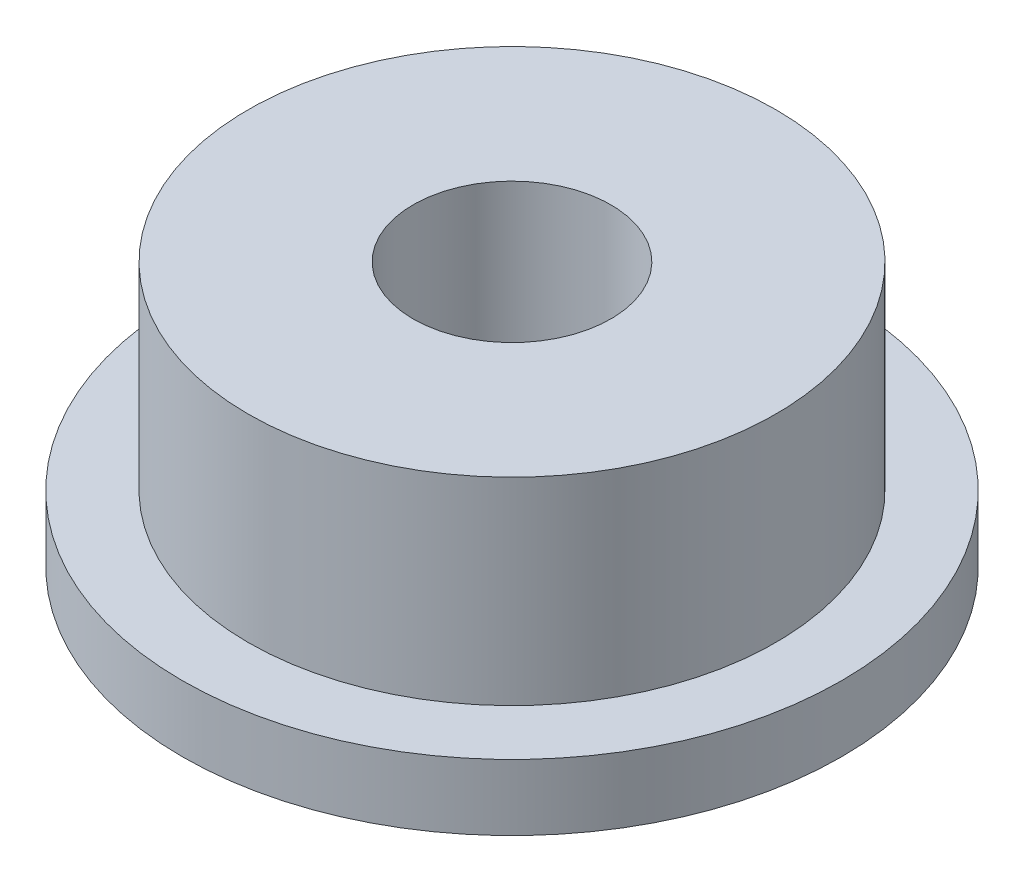
ISO-10303-21;
HEADER;
FILE_DESCRIPTION(('STEP AP214'),'2;1');
FILE_NAME('part.step','',(''),(''),'','','');
FILE_SCHEMA(('AUTOMOTIVE_DESIGN { 1 0 10303 214 1 1 1 1 }'));
ENDSEC;
DATA;
#1=APPLICATION_CONTEXT('core data for automotive mechanical design processes');
#2=APPLICATION_PROTOCOL_DEFINITION('international standard','automotive_design',2000,#1);
#3=PRODUCT_CONTEXT('',#1,'mechanical');
#4=PRODUCT('Part','Part','',(#3));
#5=PRODUCT_RELATED_PRODUCT_CATEGORY('part','',(#4));
#6=PRODUCT_DEFINITION_FORMATION('','',#4);
#7=PRODUCT_DEFINITION_CONTEXT('part definition',#1,'design');
#8=PRODUCT_DEFINITION('design','',#6,#7);
#9=PRODUCT_DEFINITION_SHAPE('','',#8);
#10=(LENGTH_UNIT() NAMED_UNIT(*) SI_UNIT(.MILLI.,.METRE.));
#11=(NAMED_UNIT(*) PLANE_ANGLE_UNIT() SI_UNIT($,.RADIAN.));
#12=(NAMED_UNIT(*) SI_UNIT($,.STERADIAN.) SOLID_ANGLE_UNIT());
#13=UNCERTAINTY_MEASURE_WITH_UNIT(LENGTH_MEASURE(1.E-05),#10,'distance_accuracy_value','');
#14=(GEOMETRIC_REPRESENTATION_CONTEXT(3) GLOBAL_UNCERTAINTY_ASSIGNED_CONTEXT((#13)) GLOBAL_UNIT_ASSIGNED_CONTEXT((#10,
#11,#12)) REPRESENTATION_CONTEXT('',''));
#15=CARTESIAN_POINT('',(0.,0.,0.));
#16=DIRECTION('',(0.,0.,1.));
#17=DIRECTION('',(1.,0.,0.));
#18=AXIS2_PLACEMENT_3D('',#15,#16,#17);
#19=CARTESIAN_POINT('',(0.,0.,0.));
#20=DIRECTION('',(0.,1.,0.));
#21=DIRECTION('',(0.,0.,1.));
#22=AXIS2_PLACEMENT_3D('',#19,#20,#21);
#23=CYLINDRICAL_SURFACE('',#22,4.);
#24=CARTESIAN_POINT('',(0.,0.,0.));
#25=DIRECTION('',(0.,1.,0.));
#26=DIRECTION('',(0.,0.,1.));
#27=AXIS2_PLACEMENT_3D('',#24,#25,#26);
#28=CIRCLE('',#27,4.);
#29=CARTESIAN_POINT('',(0.,0.,4.));
#30=VERTEX_POINT('',#29);
#31=EDGE_CURVE('E18',#30,#30,#28,.F.);
#32=ORIENTED_EDGE('',*,*,#31,.T.);
#33=EDGE_LOOP('',(#32));
#34=FACE_BOUND('',#33,.T.);
#35=CARTESIAN_POINT('',(0.,-3.,0.));
#36=DIRECTION('',(0.,1.,0.));
#37=DIRECTION('',(0.,0.,1.));
#38=AXIS2_PLACEMENT_3D('',#35,#36,#37);
#39=CIRCLE('',#38,4.);
#40=CARTESIAN_POINT('',(0.,-3.,4.));
#41=VERTEX_POINT('',#40);
#42=EDGE_CURVE('E34',#41,#41,#39,.T.);
#43=ORIENTED_EDGE('',*,*,#42,.T.);
#44=EDGE_LOOP('',(#43));
#45=FACE_BOUND('',#44,.T.);
#46=ADVANCED_FACE('F15',(#34,#45),#23,.T.);
#47=CARTESIAN_POINT('',(1.5,0.,0.));
#48=DIRECTION('',(0.,-1.,0.));
#49=DIRECTION('',(0.,0.,-1.));
#50=AXIS2_PLACEMENT_3D('',#47,#48,#49);
#51=PLANE('',#50);
#52=ORIENTED_EDGE('',*,*,#31,.F.);
#53=EDGE_LOOP('',(#52));
#54=FACE_BOUND('',#53,.T.);
#55=CARTESIAN_POINT('',(0.,0.,0.));
#56=DIRECTION('',(0.,1.,0.));
#57=DIRECTION('',(0.,0.,1.));
#58=AXIS2_PLACEMENT_3D('',#55,#56,#57);
#59=CIRCLE('',#58,1.5);
#60=CARTESIAN_POINT('',(0.,0.,1.5));
#61=VERTEX_POINT('',#60);
#62=EDGE_CURVE('E32',#61,#61,#59,.F.);
#63=ORIENTED_EDGE('',*,*,#62,.T.);
#64=EDGE_LOOP('',(#63));
#65=FACE_BOUND('',#64,.T.);
#66=ADVANCED_FACE('F42',(#54,#65),#51,.F.);
#67=CARTESIAN_POINT('',(4.,-3.,0.));
#68=DIRECTION('',(0.,-1.,0.));
#69=DIRECTION('',(0.,0.,-1.));
#70=AXIS2_PLACEMENT_3D('',#67,#68,#69);
#71=PLANE('',#70);
#72=CARTESIAN_POINT('',(0.,-3.,0.));
#73=DIRECTION('',(0.,1.,0.));
#74=DIRECTION('',(0.,0.,1.));
#75=AXIS2_PLACEMENT_3D('',#72,#73,#74);
#76=CIRCLE('',#75,5.);
#77=CARTESIAN_POINT('',(0.,-3.,5.));
#78=VERTEX_POINT('',#77);
#79=EDGE_CURVE('E27',#78,#78,#76,.F.);
#80=ORIENTED_EDGE('',*,*,#79,.F.);
#81=EDGE_LOOP('',(#80));
#82=FACE_BOUND('',#81,.T.);
#83=ORIENTED_EDGE('',*,*,#42,.F.);
#84=EDGE_LOOP('',(#83));
#85=FACE_BOUND('',#84,.T.);
#86=ADVANCED_FACE('F45',(#82,#85),#71,.F.);
#87=CARTESIAN_POINT('',(0.,0.,0.));
#88=DIRECTION('',(0.,1.,0.));
#89=DIRECTION('',(0.,0.,1.));
#90=AXIS2_PLACEMENT_3D('',#87,#88,#89);
#91=CYLINDRICAL_SURFACE('',#90,1.5);
#92=CARTESIAN_POINT('',(0.,-4.,0.));
#93=DIRECTION('',(0.,1.,0.));
#94=DIRECTION('',(0.,0.,1.));
#95=AXIS2_PLACEMENT_3D('',#92,#93,#94);
#96=CIRCLE('',#95,1.5);
#97=CARTESIAN_POINT('',(0.,-4.,1.5));
#98=VERTEX_POINT('',#97);
#99=EDGE_CURVE('E22',#98,#98,#96,.F.);
#100=ORIENTED_EDGE('',*,*,#99,.T.);
#101=EDGE_LOOP('',(#100));
#102=FACE_BOUND('',#101,.T.);
#103=ORIENTED_EDGE('',*,*,#62,.F.);
#104=EDGE_LOOP('',(#103));
#105=FACE_BOUND('',#104,.T.);
#106=ADVANCED_FACE('F48',(#102,#105),#91,.F.);
#107=CARTESIAN_POINT('',(0.,0.,0.));
#108=DIRECTION('',(0.,1.,0.));
#109=DIRECTION('',(0.,0.,1.));
#110=AXIS2_PLACEMENT_3D('',#107,#108,#109);
#111=CYLINDRICAL_SURFACE('',#110,5.);
#112=ORIENTED_EDGE('',*,*,#79,.T.);
#113=EDGE_LOOP('',(#112));
#114=FACE_BOUND('',#113,.T.);
#115=CARTESIAN_POINT('',(0.,-4.,0.));
#116=DIRECTION('',(0.,1.,0.));
#117=DIRECTION('',(0.,0.,1.));
#118=AXIS2_PLACEMENT_3D('',#115,#116,#117);
#119=CIRCLE('',#118,5.);
#120=CARTESIAN_POINT('',(0.,-4.,5.));
#121=VERTEX_POINT('',#120);
#122=EDGE_CURVE('E10',#121,#121,#119,.T.);
#123=ORIENTED_EDGE('',*,*,#122,.T.);
#124=EDGE_LOOP('',(#123));
#125=FACE_BOUND('',#124,.T.);
#126=ADVANCED_FACE('F50',(#114,#125),#111,.T.);
#127=CARTESIAN_POINT('',(5.,-4.,0.));
#128=DIRECTION('',(0.,1.,0.));
#129=DIRECTION('',(0.,0.,1.));
#130=AXIS2_PLACEMENT_3D('',#127,#128,#129);
#131=PLANE('',#130);
#132=ORIENTED_EDGE('',*,*,#122,.F.);
#133=EDGE_LOOP('',(#132));
#134=FACE_BOUND('',#133,.T.);
#135=ORIENTED_EDGE('',*,*,#99,.F.);
#136=EDGE_LOOP('',(#135));
#137=FACE_BOUND('',#136,.T.);
#138=ADVANCED_FACE('F58',(#134,#137),#131,.F.);
#139=CLOSED_SHELL('',(#46,#66,#86,#106,#126,#138));
#140=MANIFOLD_SOLID_BREP('B1',#139);
#141=ADVANCED_BREP_SHAPE_REPRESENTATION('',(#18,#140),#14);
#142=SHAPE_DEFINITION_REPRESENTATION(#9,#141);
ENDSEC;
END-ISO-10303-21;
